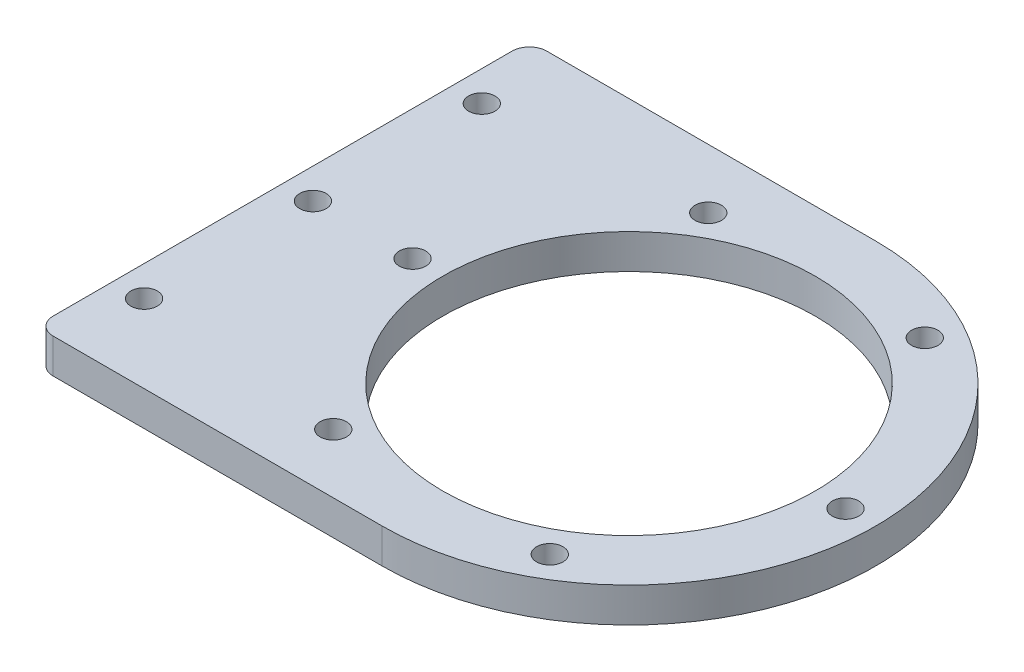
ISO-10303-21;
HEADER;
FILE_DESCRIPTION(('STEP AP214'),'2;1');
FILE_NAME('part.step','',(''),(''),'','','');
FILE_SCHEMA(('AUTOMOTIVE_DESIGN { 1 0 10303 214 1 1 1 1 }'));
ENDSEC;
DATA;
#1=APPLICATION_CONTEXT('core data for automotive mechanical design processes');
#2=APPLICATION_PROTOCOL_DEFINITION('international standard','automotive_design',2000,#1);
#3=PRODUCT_CONTEXT('',#1,'mechanical');
#4=PRODUCT('Part','Part','',(#3));
#5=PRODUCT_RELATED_PRODUCT_CATEGORY('part','',(#4));
#6=PRODUCT_DEFINITION_FORMATION('','',#4);
#7=PRODUCT_DEFINITION_CONTEXT('part definition',#1,'design');
#8=PRODUCT_DEFINITION('design','',#6,#7);
#9=PRODUCT_DEFINITION_SHAPE('','',#8);
#10=(LENGTH_UNIT() NAMED_UNIT(*) SI_UNIT(.MILLI.,.METRE.));
#11=(NAMED_UNIT(*) PLANE_ANGLE_UNIT() SI_UNIT($,.RADIAN.));
#12=(NAMED_UNIT(*) SI_UNIT($,.STERADIAN.) SOLID_ANGLE_UNIT());
#13=UNCERTAINTY_MEASURE_WITH_UNIT(LENGTH_MEASURE(1.E-05),#10,'distance_accuracy_value','');
#14=(GEOMETRIC_REPRESENTATION_CONTEXT(3) GLOBAL_UNCERTAINTY_ASSIGNED_CONTEXT((#13)) GLOBAL_UNIT_ASSIGNED_CONTEXT((#10,
#11,#12)) REPRESENTATION_CONTEXT('',''));
#15=CARTESIAN_POINT('',(0.,0.,0.));
#16=DIRECTION('',(0.,0.,1.));
#17=DIRECTION('',(1.,0.,0.));
#18=AXIS2_PLACEMENT_3D('',#15,#16,#17);
#19=CARTESIAN_POINT('',(0.,4.,28.5));
#20=DIRECTION('',(0.,0.,-1.));
#21=DIRECTION('',(-1.,0.,0.));
#22=AXIS2_PLACEMENT_3D('',#19,#20,#21);
#23=PLANE('',#22);
#24=DIRECTION('',(1.,0.,0.));
#25=VECTOR('',#24,1.);
#26=CARTESIAN_POINT('',(0.,4.,28.5));
#27=LINE('',#26,#25);
#28=CARTESIAN_POINT('',(-18.5,4.,28.5));
#29=VERTEX_POINT('',#28);
#30=CARTESIAN_POINT('',(19.5,4.,28.5));
#31=VERTEX_POINT('',#30);
#32=EDGE_CURVE('E91',#29,#31,#27,.T.);
#33=ORIENTED_EDGE('',*,*,#32,.F.);
#34=DIRECTION('',(0.,1.,0.));
#35=VECTOR('',#34,1.);
#36=CARTESIAN_POINT('',(-18.5,0.,28.5));
#37=LINE('',#36,#35);
#38=CARTESIAN_POINT('',(-18.5,0.,28.5));
#39=VERTEX_POINT('',#38);
#40=EDGE_CURVE('E11',#29,#39,#37,.F.);
#41=ORIENTED_EDGE('',*,*,#40,.T.);
#42=DIRECTION('',(1.,0.,0.));
#43=VECTOR('',#42,1.);
#44=CARTESIAN_POINT('',(0.,0.,28.5));
#45=LINE('',#44,#43);
#46=CARTESIAN_POINT('',(19.5,0.,28.5));
#47=VERTEX_POINT('',#46);
#48=EDGE_CURVE('E111',#39,#47,#45,.T.);
#49=ORIENTED_EDGE('',*,*,#48,.T.);
#50=DIRECTION('',(0.,-1.,0.));
#51=VECTOR('',#50,1.);
#52=CARTESIAN_POINT('',(19.5,4.,28.5));
#53=LINE('',#52,#51);
#54=EDGE_CURVE('E106',#31,#47,#53,.T.);
#55=ORIENTED_EDGE('',*,*,#54,.F.);
#56=EDGE_LOOP('',(#33,#41,#49,#55));
#57=FACE_BOUND('',#56,.T.);
#58=ADVANCED_FACE('F38',(#57),#23,.F.);
#59=CARTESIAN_POINT('',(19.5,4.,0.));
#60=DIRECTION('',(0.,-1.,0.));
#61=DIRECTION('',(0.,0.,-1.));
#62=AXIS2_PLACEMENT_3D('',#59,#60,#61);
#63=CYLINDRICAL_SURFACE('',#62,28.5);
#64=CARTESIAN_POINT('',(19.5,0.,0.));
#65=DIRECTION('',(0.,1.,0.));
#66=DIRECTION('',(0.,0.,1.));
#67=AXIS2_PLACEMENT_3D('',#64,#65,#66);
#68=CIRCLE('',#67,28.5);
#69=CARTESIAN_POINT('',(19.5,0.,-28.5));
#70=VERTEX_POINT('',#69);
#71=EDGE_CURVE('E137',#47,#70,#68,.T.);
#72=ORIENTED_EDGE('',*,*,#71,.T.);
#73=DIRECTION('',(0.,-1.,0.));
#74=VECTOR('',#73,1.);
#75=CARTESIAN_POINT('',(19.5,4.,-28.5));
#76=LINE('',#75,#74);
#77=CARTESIAN_POINT('',(19.5,4.,-28.5));
#78=VERTEX_POINT('',#77);
#79=EDGE_CURVE('E108',#78,#70,#76,.T.);
#80=ORIENTED_EDGE('',*,*,#79,.F.);
#81=CARTESIAN_POINT('',(19.5,4.,0.));
#82=DIRECTION('',(0.,1.,0.));
#83=DIRECTION('',(0.,0.,1.));
#84=AXIS2_PLACEMENT_3D('',#81,#82,#83);
#85=CIRCLE('',#84,28.5);
#86=EDGE_CURVE('E95',#31,#78,#85,.T.);
#87=ORIENTED_EDGE('',*,*,#86,.F.);
#88=ORIENTED_EDGE('',*,*,#54,.T.);
#89=EDGE_LOOP('',(#72,#80,#87,#88));
#90=FACE_BOUND('',#89,.T.);
#91=ADVANCED_FACE('F105',(#90),#63,.T.);
#92=CARTESIAN_POINT('',(0.,4.,-28.5));
#93=DIRECTION('',(0.,0.,-1.));
#94=DIRECTION('',(-1.,0.,0.));
#95=AXIS2_PLACEMENT_3D('',#92,#93,#94);
#96=PLANE('',#95);
#97=DIRECTION('',(1.,0.,0.));
#98=VECTOR('',#97,1.);
#99=CARTESIAN_POINT('',(0.,0.,-28.5));
#100=LINE('',#99,#98);
#101=CARTESIAN_POINT('',(-18.5,0.,-28.5));
#102=VERTEX_POINT('',#101);
#103=EDGE_CURVE('E100',#102,#70,#100,.T.);
#104=ORIENTED_EDGE('',*,*,#103,.F.);
#105=DIRECTION('',(0.,1.,0.));
#106=VECTOR('',#105,1.);
#107=CARTESIAN_POINT('',(-18.5,4.,-28.5));
#108=LINE('',#107,#106);
#109=CARTESIAN_POINT('',(-18.5,4.,-28.5));
#110=VERTEX_POINT('',#109);
#111=EDGE_CURVE('E113',#102,#110,#108,.T.);
#112=ORIENTED_EDGE('',*,*,#111,.T.);
#113=DIRECTION('',(1.,0.,0.));
#114=VECTOR('',#113,1.);
#115=CARTESIAN_POINT('',(0.,4.,-28.5));
#116=LINE('',#115,#114);
#117=EDGE_CURVE('E109',#110,#78,#116,.T.);
#118=ORIENTED_EDGE('',*,*,#117,.T.);
#119=ORIENTED_EDGE('',*,*,#79,.T.);
#120=EDGE_LOOP('',(#104,#112,#118,#119));
#121=FACE_BOUND('',#120,.T.);
#122=ADVANCED_FACE('F136',(#121),#96,.T.);
#123=CARTESIAN_POINT('',(0.,4.,0.));
#124=DIRECTION('',(0.,1.,0.));
#125=DIRECTION('',(0.,0.,1.));
#126=AXIS2_PLACEMENT_3D('',#123,#124,#125);
#127=PLANE('',#126);
#128=CARTESIAN_POINT('',(-17.0000000000104,4.,-19.5));
#129=DIRECTION('',(0.,1.,0.));
#130=DIRECTION('',(0.,0.,1.));
#131=AXIS2_PLACEMENT_3D('',#128,#129,#130);
#132=CIRCLE('',#131,1.52499999999956);
#133=CARTESIAN_POINT('',(-17.0000000000104,4.,-17.9750000000004));
#134=VERTEX_POINT('',#133);
#135=EDGE_CURVE('E150',#134,#134,#132,.T.);
#136=ORIENTED_EDGE('',*,*,#135,.F.);
#137=EDGE_LOOP('',(#136));
#138=FACE_BOUND('',#137,.T.);
#139=CARTESIAN_POINT('',(-17.0000000000104,4.,0.));
#140=DIRECTION('',(0.,1.,0.));
#141=DIRECTION('',(0.,0.,1.));
#142=AXIS2_PLACEMENT_3D('',#139,#140,#141);
#143=CIRCLE('',#142,1.52499999999983);
#144=CARTESIAN_POINT('',(-17.0000000000104,4.,1.52499999999985));
#145=VERTEX_POINT('',#144);
#146=EDGE_CURVE('E156',#145,#145,#143,.T.);
#147=ORIENTED_EDGE('',*,*,#146,.F.);
#148=EDGE_LOOP('',(#147));
#149=FACE_BOUND('',#148,.T.);
#150=CARTESIAN_POINT('',(-17.0000000000104,4.,19.5));
#151=DIRECTION('',(0.,1.,0.));
#152=DIRECTION('',(0.,0.,1.));
#153=AXIS2_PLACEMENT_3D('',#150,#151,#152);
#154=CIRCLE('',#153,1.52500000000011);
#155=CARTESIAN_POINT('',(-17.0000000000104,4.,21.0250000000001));
#156=VERTEX_POINT('',#155);
#157=EDGE_CURVE('E143',#156,#156,#154,.T.);
#158=ORIENTED_EDGE('',*,*,#157,.F.);
#159=EDGE_LOOP('',(#158));
#160=FACE_BOUND('',#159,.T.);
#161=CARTESIAN_POINT('',(-5.50000000000002,4.,0.));
#162=DIRECTION('',(0.,1.,0.));
#163=DIRECTION('',(0.,0.,1.));
#164=AXIS2_PLACEMENT_3D('',#161,#162,#163);
#165=CIRCLE('',#164,1.525);
#166=CARTESIAN_POINT('',(-5.50000000000002,4.,1.525));
#167=VERTEX_POINT('',#166);
#168=EDGE_CURVE('E168',#167,#167,#165,.T.);
#169=ORIENTED_EDGE('',*,*,#168,.F.);
#170=EDGE_LOOP('',(#169));
#171=FACE_BOUND('',#170,.T.);
#172=CARTESIAN_POINT('',(6.99999999999999,4.,21.650635094611));
#173=DIRECTION('',(0.,1.,0.));
#174=DIRECTION('',(0.,0.,1.));
#175=AXIS2_PLACEMENT_3D('',#172,#173,#174);
#176=CIRCLE('',#175,1.525);
#177=CARTESIAN_POINT('',(6.99999999999999,4.,23.175635094611));
#178=VERTEX_POINT('',#177);
#179=EDGE_CURVE('E149',#178,#178,#176,.T.);
#180=ORIENTED_EDGE('',*,*,#179,.F.);
#181=EDGE_LOOP('',(#180));
#182=FACE_BOUND('',#181,.T.);
#183=CARTESIAN_POINT('',(32.,4.,21.650635094611));
#184=DIRECTION('',(0.,1.,0.));
#185=DIRECTION('',(0.,0.,1.));
#186=AXIS2_PLACEMENT_3D('',#183,#184,#185);
#187=CIRCLE('',#186,1.525);
#188=CARTESIAN_POINT('',(32.,4.,23.175635094611));
#189=VERTEX_POINT('',#188);
#190=EDGE_CURVE('E175',#189,#189,#187,.T.);
#191=ORIENTED_EDGE('',*,*,#190,.F.);
#192=EDGE_LOOP('',(#191));
#193=FACE_BOUND('',#192,.T.);
#194=CARTESIAN_POINT('',(44.5,4.,0.));
#195=DIRECTION('',(0.,1.,0.));
#196=DIRECTION('',(0.,0.,1.));
#197=AXIS2_PLACEMENT_3D('',#194,#195,#196);
#198=CIRCLE('',#197,1.525);
#199=CARTESIAN_POINT('',(44.5,4.,1.52499999999999));
#200=VERTEX_POINT('',#199);
#201=EDGE_CURVE('E192',#200,#200,#198,.T.);
#202=ORIENTED_EDGE('',*,*,#201,.F.);
#203=EDGE_LOOP('',(#202));
#204=FACE_BOUND('',#203,.T.);
#205=CARTESIAN_POINT('',(32.,4.,-21.650635094611));
#206=DIRECTION('',(0.,1.,0.));
#207=DIRECTION('',(0.,0.,1.));
#208=AXIS2_PLACEMENT_3D('',#205,#206,#207);
#209=CIRCLE('',#208,1.525);
#210=CARTESIAN_POINT('',(32.,4.,-20.125635094611));
#211=VERTEX_POINT('',#210);
#212=EDGE_CURVE('E186',#211,#211,#209,.T.);
#213=ORIENTED_EDGE('',*,*,#212,.F.);
#214=EDGE_LOOP('',(#213));
#215=FACE_BOUND('',#214,.T.);
#216=CARTESIAN_POINT('',(6.99999999999997,4.,-21.650635094611));
#217=DIRECTION('',(0.,1.,0.));
#218=DIRECTION('',(0.,0.,1.));
#219=AXIS2_PLACEMENT_3D('',#216,#217,#218);
#220=CIRCLE('',#219,1.525);
#221=CARTESIAN_POINT('',(6.99999999999997,4.,-20.125635094611));
#222=VERTEX_POINT('',#221);
#223=EDGE_CURVE('E180',#222,#222,#220,.T.);
#224=ORIENTED_EDGE('',*,*,#223,.F.);
#225=EDGE_LOOP('',(#224));
#226=FACE_BOUND('',#225,.T.);
#227=CARTESIAN_POINT('',(19.5,4.,0.));
#228=DIRECTION('',(0.,1.,0.));
#229=DIRECTION('',(0.,0.,1.));
#230=AXIS2_PLACEMENT_3D('',#227,#228,#229);
#231=CIRCLE('',#230,21.5);
#232=CARTESIAN_POINT('',(19.5,4.,21.5));
#233=VERTEX_POINT('',#232);
#234=EDGE_CURVE('E167',#233,#233,#231,.T.);
#235=ORIENTED_EDGE('',*,*,#234,.F.);
#236=EDGE_LOOP('',(#235));
#237=FACE_BOUND('',#236,.T.);
#238=ORIENTED_EDGE('',*,*,#117,.F.);
#239=CARTESIAN_POINT('',(-18.5,4.,-26.5));
#240=DIRECTION('',(0.,1.,0.));
#241=DIRECTION('',(0.,0.,1.));
#242=AXIS2_PLACEMENT_3D('',#239,#240,#241);
#243=CIRCLE('',#242,2.);
#244=CARTESIAN_POINT('',(-20.5,4.,-26.5));
#245=VERTEX_POINT('',#244);
#246=EDGE_CURVE('E121',#110,#245,#243,.T.);
#247=ORIENTED_EDGE('',*,*,#246,.T.);
#248=DIRECTION('',(0.,0.,1.));
#249=VECTOR('',#248,1.);
#250=CARTESIAN_POINT('',(-20.5,4.,-28.5));
#251=LINE('',#250,#249);
#252=CARTESIAN_POINT('',(-20.5,4.,26.5));
#253=VERTEX_POINT('',#252);
#254=EDGE_CURVE('E139',#245,#253,#251,.T.);
#255=ORIENTED_EDGE('',*,*,#254,.T.);
#256=CARTESIAN_POINT('',(-18.5,4.,26.5));
#257=DIRECTION('',(0.,1.,0.));
#258=DIRECTION('',(0.,0.,1.));
#259=AXIS2_PLACEMENT_3D('',#256,#257,#258);
#260=CIRCLE('',#259,2.);
#261=EDGE_CURVE('E98',#253,#29,#260,.T.);
#262=ORIENTED_EDGE('',*,*,#261,.T.);
#263=ORIENTED_EDGE('',*,*,#32,.T.);
#264=ORIENTED_EDGE('',*,*,#86,.T.);
#265=EDGE_LOOP('',(#238,#247,#255,#262,#263,#264));
#266=FACE_BOUND('',#265,.T.);
#267=ADVANCED_FACE('F94',(#138,#149,#160,#171,#182,#193,#204,#215,#226,#237,#266),#127,.T.);
#268=CARTESIAN_POINT('',(0.,0.,0.));
#269=DIRECTION('',(0.,1.,0.));
#270=DIRECTION('',(0.,0.,1.));
#271=AXIS2_PLACEMENT_3D('',#268,#269,#270);
#272=PLANE('',#271);
#273=CARTESIAN_POINT('',(-17.0000000000104,0.,-19.5));
#274=DIRECTION('',(0.,1.,0.));
#275=DIRECTION('',(0.,0.,1.));
#276=AXIS2_PLACEMENT_3D('',#273,#274,#275);
#277=CIRCLE('',#276,1.52499999999956);
#278=CARTESIAN_POINT('',(-17.0000000000104,0.,-17.9750000000004));
#279=VERTEX_POINT('',#278);
#280=EDGE_CURVE('E146',#279,#279,#277,.T.);
#281=ORIENTED_EDGE('',*,*,#280,.T.);
#282=EDGE_LOOP('',(#281));
#283=FACE_BOUND('',#282,.T.);
#284=CARTESIAN_POINT('',(-17.0000000000104,0.,0.));
#285=DIRECTION('',(0.,1.,0.));
#286=DIRECTION('',(0.,0.,1.));
#287=AXIS2_PLACEMENT_3D('',#284,#285,#286);
#288=CIRCLE('',#287,1.52499999999983);
#289=CARTESIAN_POINT('',(-17.0000000000104,0.,1.52499999999985));
#290=VERTEX_POINT('',#289);
#291=EDGE_CURVE('E153',#290,#290,#288,.T.);
#292=ORIENTED_EDGE('',*,*,#291,.T.);
#293=EDGE_LOOP('',(#292));
#294=FACE_BOUND('',#293,.T.);
#295=CARTESIAN_POINT('',(-17.0000000000104,0.,19.5));
#296=DIRECTION('',(0.,1.,0.));
#297=DIRECTION('',(0.,0.,1.));
#298=AXIS2_PLACEMENT_3D('',#295,#296,#297);
#299=CIRCLE('',#298,1.52500000000011);
#300=CARTESIAN_POINT('',(-17.0000000000104,0.,21.0250000000001));
#301=VERTEX_POINT('',#300);
#302=EDGE_CURVE('E159',#301,#301,#299,.T.);
#303=ORIENTED_EDGE('',*,*,#302,.T.);
#304=EDGE_LOOP('',(#303));
#305=FACE_BOUND('',#304,.T.);
#306=CARTESIAN_POINT('',(-5.50000000000002,0.,0.));
#307=DIRECTION('',(0.,1.,0.));
#308=DIRECTION('',(0.,0.,1.));
#309=AXIS2_PLACEMENT_3D('',#306,#307,#308);
#310=CIRCLE('',#309,1.525);
#311=CARTESIAN_POINT('',(-5.50000000000002,0.,1.525));
#312=VERTEX_POINT('',#311);
#313=EDGE_CURVE('E164',#312,#312,#310,.T.);
#314=ORIENTED_EDGE('',*,*,#313,.T.);
#315=EDGE_LOOP('',(#314));
#316=FACE_BOUND('',#315,.T.);
#317=CARTESIAN_POINT('',(6.99999999999999,0.,21.650635094611));
#318=DIRECTION('',(0.,1.,0.));
#319=DIRECTION('',(0.,0.,1.));
#320=AXIS2_PLACEMENT_3D('',#317,#318,#319);
#321=CIRCLE('',#320,1.525);
#322=CARTESIAN_POINT('',(6.99999999999999,0.,23.175635094611));
#323=VERTEX_POINT('',#322);
#324=EDGE_CURVE('E172',#323,#323,#321,.T.);
#325=ORIENTED_EDGE('',*,*,#324,.T.);
#326=EDGE_LOOP('',(#325));
#327=FACE_BOUND('',#326,.T.);
#328=CARTESIAN_POINT('',(32.,0.,21.650635094611));
#329=DIRECTION('',(0.,1.,0.));
#330=DIRECTION('',(0.,0.,1.));
#331=AXIS2_PLACEMENT_3D('',#328,#329,#330);
#332=CIRCLE('',#331,1.525);
#333=CARTESIAN_POINT('',(32.,0.,23.175635094611));
#334=VERTEX_POINT('',#333);
#335=EDGE_CURVE('E195',#334,#334,#332,.T.);
#336=ORIENTED_EDGE('',*,*,#335,.T.);
#337=EDGE_LOOP('',(#336));
#338=FACE_BOUND('',#337,.T.);
#339=CARTESIAN_POINT('',(44.5,0.,0.));
#340=DIRECTION('',(0.,1.,0.));
#341=DIRECTION('',(0.,0.,1.));
#342=AXIS2_PLACEMENT_3D('',#339,#340,#341);
#343=CIRCLE('',#342,1.525);
#344=CARTESIAN_POINT('',(44.5,0.,1.52499999999999));
#345=VERTEX_POINT('',#344);
#346=EDGE_CURVE('E189',#345,#345,#343,.T.);
#347=ORIENTED_EDGE('',*,*,#346,.T.);
#348=EDGE_LOOP('',(#347));
#349=FACE_BOUND('',#348,.T.);
#350=CARTESIAN_POINT('',(32.,0.,-21.650635094611));
#351=DIRECTION('',(0.,1.,0.));
#352=DIRECTION('',(0.,0.,1.));
#353=AXIS2_PLACEMENT_3D('',#350,#351,#352);
#354=CIRCLE('',#353,1.525);
#355=CARTESIAN_POINT('',(32.,0.,-20.125635094611));
#356=VERTEX_POINT('',#355);
#357=EDGE_CURVE('E183',#356,#356,#354,.T.);
#358=ORIENTED_EDGE('',*,*,#357,.T.);
#359=EDGE_LOOP('',(#358));
#360=FACE_BOUND('',#359,.T.);
#361=CARTESIAN_POINT('',(6.99999999999997,0.,-21.650635094611));
#362=DIRECTION('',(0.,1.,0.));
#363=DIRECTION('',(0.,0.,1.));
#364=AXIS2_PLACEMENT_3D('',#361,#362,#363);
#365=CIRCLE('',#364,1.525);
#366=CARTESIAN_POINT('',(6.99999999999997,0.,-20.125635094611));
#367=VERTEX_POINT('',#366);
#368=EDGE_CURVE('E171',#367,#367,#365,.T.);
#369=ORIENTED_EDGE('',*,*,#368,.T.);
#370=EDGE_LOOP('',(#369));
#371=FACE_BOUND('',#370,.T.);
#372=CARTESIAN_POINT('',(19.5,0.,0.));
#373=DIRECTION('',(0.,1.,0.));
#374=DIRECTION('',(0.,0.,1.));
#375=AXIS2_PLACEMENT_3D('',#372,#373,#374);
#376=CIRCLE('',#375,21.5);
#377=CARTESIAN_POINT('',(19.5,0.,21.5));
#378=VERTEX_POINT('',#377);
#379=EDGE_CURVE('E200',#378,#378,#376,.T.);
#380=ORIENTED_EDGE('',*,*,#379,.T.);
#381=EDGE_LOOP('',(#380));
#382=FACE_BOUND('',#381,.T.);
#383=DIRECTION('',(0.,0.,-1.));
#384=VECTOR('',#383,1.);
#385=CARTESIAN_POINT('',(-20.5,0.,-28.5));
#386=LINE('',#385,#384);
#387=CARTESIAN_POINT('',(-20.5,0.,26.5));
#388=VERTEX_POINT('',#387);
#389=CARTESIAN_POINT('',(-20.5,0.,-26.5));
#390=VERTEX_POINT('',#389);
#391=EDGE_CURVE('E132',#388,#390,#386,.T.);
#392=ORIENTED_EDGE('',*,*,#391,.T.);
#393=CARTESIAN_POINT('',(-18.5,0.,-26.5));
#394=DIRECTION('',(0.,1.,0.));
#395=DIRECTION('',(0.,0.,1.));
#396=AXIS2_PLACEMENT_3D('',#393,#394,#395);
#397=CIRCLE('',#396,2.);
#398=EDGE_CURVE('E46',#390,#102,#397,.F.);
#399=ORIENTED_EDGE('',*,*,#398,.T.);
#400=ORIENTED_EDGE('',*,*,#103,.T.);
#401=ORIENTED_EDGE('',*,*,#71,.F.);
#402=ORIENTED_EDGE('',*,*,#48,.F.);
#403=CARTESIAN_POINT('',(-18.5,0.,26.5));
#404=DIRECTION('',(0.,1.,0.));
#405=DIRECTION('',(0.,0.,1.));
#406=AXIS2_PLACEMENT_3D('',#403,#404,#405);
#407=CIRCLE('',#406,2.);
#408=EDGE_CURVE('E127',#39,#388,#407,.F.);
#409=ORIENTED_EDGE('',*,*,#408,.T.);
#410=EDGE_LOOP('',(#392,#399,#400,#401,#402,#409));
#411=FACE_BOUND('',#410,.T.);
#412=ADVANCED_FACE('F131',(#283,#294,#305,#316,#327,#338,#349,#360,#371,#382,#411),#272,.F.);
#413=CARTESIAN_POINT('',(19.5,0.,0.));
#414=DIRECTION('',(0.,1.,0.));
#415=DIRECTION('',(0.,0.,1.));
#416=AXIS2_PLACEMENT_3D('',#413,#414,#415);
#417=CYLINDRICAL_SURFACE('',#416,21.5);
#418=ORIENTED_EDGE('',*,*,#379,.F.);
#419=EDGE_LOOP('',(#418));
#420=FACE_BOUND('',#419,.T.);
#421=ORIENTED_EDGE('',*,*,#234,.T.);
#422=EDGE_LOOP('',(#421));
#423=FACE_BOUND('',#422,.T.);
#424=ADVANCED_FACE('F224',(#420,#423),#417,.F.);
#425=CARTESIAN_POINT('',(6.99999999999997,0.,-21.650635094611));
#426=DIRECTION('',(0.,1.,0.));
#427=DIRECTION('',(0.,0.,1.));
#428=AXIS2_PLACEMENT_3D('',#425,#426,#427);
#429=CYLINDRICAL_SURFACE('',#428,1.525);
#430=ORIENTED_EDGE('',*,*,#368,.F.);
#431=EDGE_LOOP('',(#430));
#432=FACE_BOUND('',#431,.T.);
#433=ORIENTED_EDGE('',*,*,#223,.T.);
#434=EDGE_LOOP('',(#433));
#435=FACE_BOUND('',#434,.T.);
#436=ADVANCED_FACE('F231',(#432,#435),#429,.F.);
#437=CARTESIAN_POINT('',(32.,0.,-21.650635094611));
#438=DIRECTION('',(0.,1.,0.));
#439=DIRECTION('',(0.,0.,1.));
#440=AXIS2_PLACEMENT_3D('',#437,#438,#439);
#441=CYLINDRICAL_SURFACE('',#440,1.525);
#442=ORIENTED_EDGE('',*,*,#357,.F.);
#443=EDGE_LOOP('',(#442));
#444=FACE_BOUND('',#443,.T.);
#445=ORIENTED_EDGE('',*,*,#212,.T.);
#446=EDGE_LOOP('',(#445));
#447=FACE_BOUND('',#446,.T.);
#448=ADVANCED_FACE('F241',(#444,#447),#441,.F.);
#449=CARTESIAN_POINT('',(44.5,0.,0.));
#450=DIRECTION('',(0.,1.,0.));
#451=DIRECTION('',(0.,0.,1.));
#452=AXIS2_PLACEMENT_3D('',#449,#450,#451);
#453=CYLINDRICAL_SURFACE('',#452,1.525);
#454=ORIENTED_EDGE('',*,*,#346,.F.);
#455=EDGE_LOOP('',(#454));
#456=FACE_BOUND('',#455,.T.);
#457=ORIENTED_EDGE('',*,*,#201,.T.);
#458=EDGE_LOOP('',(#457));
#459=FACE_BOUND('',#458,.T.);
#460=ADVANCED_FACE('F237',(#456,#459),#453,.F.);
#461=CARTESIAN_POINT('',(32.,0.,21.650635094611));
#462=DIRECTION('',(0.,1.,0.));
#463=DIRECTION('',(0.,0.,1.));
#464=AXIS2_PLACEMENT_3D('',#461,#462,#463);
#465=CYLINDRICAL_SURFACE('',#464,1.525);
#466=ORIENTED_EDGE('',*,*,#335,.F.);
#467=EDGE_LOOP('',(#466));
#468=FACE_BOUND('',#467,.T.);
#469=ORIENTED_EDGE('',*,*,#190,.T.);
#470=EDGE_LOOP('',(#469));
#471=FACE_BOUND('',#470,.T.);
#472=ADVANCED_FACE('F233',(#468,#471),#465,.F.);
#473=CARTESIAN_POINT('',(6.99999999999999,0.,21.650635094611));
#474=DIRECTION('',(0.,1.,0.));
#475=DIRECTION('',(0.,0.,1.));
#476=AXIS2_PLACEMENT_3D('',#473,#474,#475);
#477=CYLINDRICAL_SURFACE('',#476,1.525);
#478=ORIENTED_EDGE('',*,*,#324,.F.);
#479=EDGE_LOOP('',(#478));
#480=FACE_BOUND('',#479,.T.);
#481=ORIENTED_EDGE('',*,*,#179,.T.);
#482=EDGE_LOOP('',(#481));
#483=FACE_BOUND('',#482,.T.);
#484=ADVANCED_FACE('F236',(#480,#483),#477,.F.);
#485=CARTESIAN_POINT('',(-5.50000000000002,0.,0.));
#486=DIRECTION('',(0.,1.,0.));
#487=DIRECTION('',(0.,0.,1.));
#488=AXIS2_PLACEMENT_3D('',#485,#486,#487);
#489=CYLINDRICAL_SURFACE('',#488,1.525);
#490=ORIENTED_EDGE('',*,*,#313,.F.);
#491=EDGE_LOOP('',(#490));
#492=FACE_BOUND('',#491,.T.);
#493=ORIENTED_EDGE('',*,*,#168,.T.);
#494=EDGE_LOOP('',(#493));
#495=FACE_BOUND('',#494,.T.);
#496=ADVANCED_FACE('F251',(#492,#495),#489,.F.);
#497=CARTESIAN_POINT('',(-17.0000000000104,0.,19.5));
#498=DIRECTION('',(0.,1.,0.));
#499=DIRECTION('',(0.,0.,1.));
#500=AXIS2_PLACEMENT_3D('',#497,#498,#499);
#501=CYLINDRICAL_SURFACE('',#500,1.52500000000011);
#502=ORIENTED_EDGE('',*,*,#302,.F.);
#503=EDGE_LOOP('',(#502));
#504=FACE_BOUND('',#503,.T.);
#505=ORIENTED_EDGE('',*,*,#157,.T.);
#506=EDGE_LOOP('',(#505));
#507=FACE_BOUND('',#506,.T.);
#508=ADVANCED_FACE('F255',(#504,#507),#501,.F.);
#509=CARTESIAN_POINT('',(-17.0000000000104,0.,0.));
#510=DIRECTION('',(0.,1.,0.));
#511=DIRECTION('',(0.,0.,1.));
#512=AXIS2_PLACEMENT_3D('',#509,#510,#511);
#513=CYLINDRICAL_SURFACE('',#512,1.52499999999983);
#514=ORIENTED_EDGE('',*,*,#291,.F.);
#515=EDGE_LOOP('',(#514));
#516=FACE_BOUND('',#515,.T.);
#517=ORIENTED_EDGE('',*,*,#146,.T.);
#518=EDGE_LOOP('',(#517));
#519=FACE_BOUND('',#518,.T.);
#520=ADVANCED_FACE('F259',(#516,#519),#513,.F.);
#521=CARTESIAN_POINT('',(-17.0000000000104,0.,-19.5));
#522=DIRECTION('',(0.,1.,0.));
#523=DIRECTION('',(0.,0.,1.));
#524=AXIS2_PLACEMENT_3D('',#521,#522,#523);
#525=CYLINDRICAL_SURFACE('',#524,1.52499999999956);
#526=ORIENTED_EDGE('',*,*,#280,.F.);
#527=EDGE_LOOP('',(#526));
#528=FACE_BOUND('',#527,.T.);
#529=ORIENTED_EDGE('',*,*,#135,.T.);
#530=EDGE_LOOP('',(#529));
#531=FACE_BOUND('',#530,.T.);
#532=ADVANCED_FACE('F263',(#528,#531),#525,.F.);
#533=CARTESIAN_POINT('',(-20.5,-57.0087712549569,-28.5));
#534=DIRECTION('',(-1.,0.,0.));
#535=DIRECTION('',(0.,0.,1.));
#536=AXIS2_PLACEMENT_3D('',#533,#534,#535);
#537=PLANE('',#536);
#538=ORIENTED_EDGE('',*,*,#254,.F.);
#539=DIRECTION('',(0.,1.,0.));
#540=VECTOR('',#539,1.);
#541=CARTESIAN_POINT('',(-20.5,-57.0087712549569,-26.5));
#542=LINE('',#541,#540);
#543=EDGE_CURVE('E59',#245,#390,#542,.F.);
#544=ORIENTED_EDGE('',*,*,#543,.T.);
#545=ORIENTED_EDGE('',*,*,#391,.F.);
#546=DIRECTION('',(0.,1.,0.));
#547=VECTOR('',#546,1.);
#548=CARTESIAN_POINT('',(-20.5,4.,26.5));
#549=LINE('',#548,#547);
#550=EDGE_CURVE('E123',#388,#253,#549,.T.);
#551=ORIENTED_EDGE('',*,*,#550,.T.);
#552=EDGE_LOOP('',(#538,#544,#545,#551));
#553=FACE_BOUND('',#552,.T.);
#554=ADVANCED_FACE('F140',(#553),#537,.T.);
#555=CARTESIAN_POINT('',(-18.5,4.,-26.5));
#556=DIRECTION('',(0.,1.,0.));
#557=DIRECTION('',(0.,0.,1.));
#558=AXIS2_PLACEMENT_3D('',#555,#556,#557);
#559=CYLINDRICAL_SURFACE('',#558,2.);
#560=ORIENTED_EDGE('',*,*,#398,.F.);
#561=ORIENTED_EDGE('',*,*,#543,.F.);
#562=ORIENTED_EDGE('',*,*,#246,.F.);
#563=ORIENTED_EDGE('',*,*,#111,.F.);
#564=EDGE_LOOP('',(#560,#561,#562,#563));
#565=FACE_BOUND('',#564,.T.);
#566=ADVANCED_FACE('F138',(#565),#559,.T.);
#567=CARTESIAN_POINT('',(-18.5,-57.0087712549569,26.5));
#568=DIRECTION('',(0.,-1.,0.));
#569=DIRECTION('',(0.,0.,-1.));
#570=AXIS2_PLACEMENT_3D('',#567,#568,#569);
#571=CYLINDRICAL_SURFACE('',#570,2.);
#572=ORIENTED_EDGE('',*,*,#408,.F.);
#573=ORIENTED_EDGE('',*,*,#40,.F.);
#574=ORIENTED_EDGE('',*,*,#261,.F.);
#575=ORIENTED_EDGE('',*,*,#550,.F.);
#576=EDGE_LOOP('',(#572,#573,#574,#575));
#577=FACE_BOUND('',#576,.T.);
#578=ADVANCED_FACE('F40',(#577),#571,.T.);
#579=CLOSED_SHELL('',(#58,#91,#122,#267,#412,#424,#436,#448,#460,#472,#484,#496,#508,#520,#532,
#554,#566,#578));
#580=MANIFOLD_SOLID_BREP('B2',#579);
#581=ADVANCED_BREP_SHAPE_REPRESENTATION('',(#18,#580),#14);
#582=SHAPE_DEFINITION_REPRESENTATION(#9,#581);
ENDSEC;
END-ISO-10303-21;
